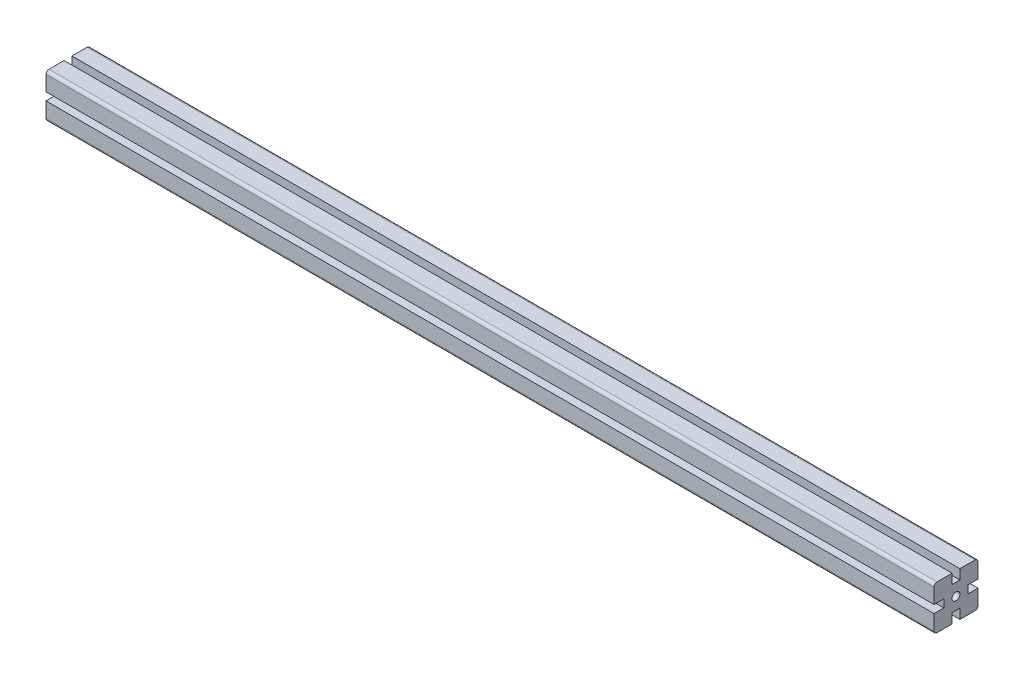
ISO-10303-21;
HEADER;
FILE_DESCRIPTION(('STEP AP214'),'2;1');
FILE_NAME('part.step','',(''),(''),'','','');
FILE_SCHEMA(('AUTOMOTIVE_DESIGN { 1 0 10303 214 1 1 1 1 }'));
ENDSEC;
DATA;
#1=APPLICATION_CONTEXT('core data for automotive mechanical design processes');
#2=APPLICATION_PROTOCOL_DEFINITION('international standard','automotive_design',2000,#1);
#3=PRODUCT_CONTEXT('',#1,'mechanical');
#4=PRODUCT('Part','Part','',(#3));
#5=PRODUCT_RELATED_PRODUCT_CATEGORY('part','',(#4));
#6=PRODUCT_DEFINITION_FORMATION('','',#4);
#7=PRODUCT_DEFINITION_CONTEXT('part definition',#1,'design');
#8=PRODUCT_DEFINITION('design','',#6,#7);
#9=PRODUCT_DEFINITION_SHAPE('','',#8);
#10=(LENGTH_UNIT() NAMED_UNIT(*) SI_UNIT(.MILLI.,.METRE.));
#11=(NAMED_UNIT(*) PLANE_ANGLE_UNIT() SI_UNIT($,.RADIAN.));
#12=(NAMED_UNIT(*) SI_UNIT($,.STERADIAN.) SOLID_ANGLE_UNIT());
#13=UNCERTAINTY_MEASURE_WITH_UNIT(LENGTH_MEASURE(1.E-05),#10,'distance_accuracy_value','');
#14=(GEOMETRIC_REPRESENTATION_CONTEXT(3) GLOBAL_UNCERTAINTY_ASSIGNED_CONTEXT((#13)) GLOBAL_UNIT_ASSIGNED_CONTEXT((#10,
#11,#12)) REPRESENTATION_CONTEXT('',''));
#15=CARTESIAN_POINT('',(0.,0.,0.));
#16=DIRECTION('',(0.,0.,1.));
#17=DIRECTION('',(1.,0.,0.));
#18=AXIS2_PLACEMENT_3D('',#15,#16,#17);
#19=CARTESIAN_POINT('',(92.,-22.5,-22.5));
#20=DIRECTION('',(0.,0.,-1.));
#21=DIRECTION('',(0.,1.,0.));
#22=AXIS2_PLACEMENT_3D('',#19,#20,#21);
#23=PLANE('',#22);
#24=DIRECTION('',(0.,1.,0.));
#25=VECTOR('',#24,1.);
#26=CARTESIAN_POINT('',(1000.,-22.5,-22.5));
#27=LINE('',#26,#25);
#28=CARTESIAN_POINT('',(1000.,-19.5,-22.5));
#29=VERTEX_POINT('',#28);
#30=CARTESIAN_POINT('',(1000.,-4.,-22.5));
#31=VERTEX_POINT('',#30);
#32=EDGE_CURVE('E269',#29,#31,#27,.T.);
#33=ORIENTED_EDGE('',*,*,#32,.F.);
#34=DIRECTION('',(1.,0.,0.));
#35=VECTOR('',#34,1.);
#36=CARTESIAN_POINT('',(92.,-19.5,-22.5));
#37=LINE('',#36,#35);
#38=CARTESIAN_POINT('',(92.,-19.5,-22.5));
#39=VERTEX_POINT('',#38);
#40=EDGE_CURVE('E199',#29,#39,#37,.F.);
#41=ORIENTED_EDGE('',*,*,#40,.T.);
#42=DIRECTION('',(0.,1.,0.));
#43=VECTOR('',#42,1.);
#44=CARTESIAN_POINT('',(92.,-22.5,-22.5));
#45=LINE('',#44,#43);
#46=CARTESIAN_POINT('',(92.,-4.,-22.5));
#47=VERTEX_POINT('',#46);
#48=EDGE_CURVE('E193',#39,#47,#45,.T.);
#49=ORIENTED_EDGE('',*,*,#48,.T.);
#50=DIRECTION('',(1.,0.,0.));
#51=VECTOR('',#50,1.);
#52=CARTESIAN_POINT('',(92.,-4.,-22.5));
#53=LINE('',#52,#51);
#54=EDGE_CURVE('E196',#47,#31,#53,.T.);
#55=ORIENTED_EDGE('',*,*,#54,.T.);
#56=EDGE_LOOP('',(#33,#41,#49,#55));
#57=FACE_BOUND('',#56,.T.);
#58=ADVANCED_FACE('F32',(#57),#23,.T.);
#59=CARTESIAN_POINT('',(92.,-22.5,-4.));
#60=DIRECTION('',(0.,-1.,0.));
#61=DIRECTION('',(0.,0.,-1.));
#62=AXIS2_PLACEMENT_3D('',#59,#60,#61);
#63=PLANE('',#62);
#64=DIRECTION('',(0.,0.,-1.));
#65=VECTOR('',#64,1.);
#66=CARTESIAN_POINT('',(92.,-22.5,-4.));
#67=LINE('',#66,#65);
#68=CARTESIAN_POINT('',(92.,-22.5,-4.));
#69=VERTEX_POINT('',#68);
#70=CARTESIAN_POINT('',(92.,-22.5,-19.5));
#71=VERTEX_POINT('',#70);
#72=EDGE_CURVE('E211',#69,#71,#67,.T.);
#73=ORIENTED_EDGE('',*,*,#72,.T.);
#74=DIRECTION('',(1.,0.,0.));
#75=VECTOR('',#74,1.);
#76=CARTESIAN_POINT('',(92.,-22.5,-19.5));
#77=LINE('',#76,#75);
#78=CARTESIAN_POINT('',(1000.,-22.5,-19.5));
#79=VERTEX_POINT('',#78);
#80=EDGE_CURVE('E375',#71,#79,#77,.T.);
#81=ORIENTED_EDGE('',*,*,#80,.T.);
#82=DIRECTION('',(0.,0.,-1.));
#83=VECTOR('',#82,1.);
#84=CARTESIAN_POINT('',(1000.,-22.5,-4.));
#85=LINE('',#84,#83);
#86=CARTESIAN_POINT('',(1000.,-22.5,-4.));
#87=VERTEX_POINT('',#86);
#88=EDGE_CURVE('E203',#87,#79,#85,.T.);
#89=ORIENTED_EDGE('',*,*,#88,.F.);
#90=DIRECTION('',(1.,0.,0.));
#91=VECTOR('',#90,1.);
#92=CARTESIAN_POINT('',(92.,-22.5,-4.));
#93=LINE('',#92,#91);
#94=EDGE_CURVE('E323',#69,#87,#93,.T.);
#95=ORIENTED_EDGE('',*,*,#94,.F.);
#96=EDGE_LOOP('',(#73,#81,#89,#95));
#97=FACE_BOUND('',#96,.T.);
#98=ADVANCED_FACE('F403',(#97),#63,.T.);
#99=CARTESIAN_POINT('',(92.,-12.5,-4.));
#100=DIRECTION('',(0.,0.,1.));
#101=DIRECTION('',(1.,0.,0.));
#102=AXIS2_PLACEMENT_3D('',#99,#100,#101);
#103=PLANE('',#102);
#104=DIRECTION('',(0.,-1.,0.));
#105=VECTOR('',#104,1.);
#106=CARTESIAN_POINT('',(1000.,-12.5,-4.));
#107=LINE('',#106,#105);
#108=CARTESIAN_POINT('',(1000.,-12.5,-4.));
#109=VERTEX_POINT('',#108);
#110=EDGE_CURVE('E318',#109,#87,#107,.T.);
#111=ORIENTED_EDGE('',*,*,#110,.F.);
#112=DIRECTION('',(1.,0.,0.));
#113=VECTOR('',#112,1.);
#114=CARTESIAN_POINT('',(92.,-12.5,-4.));
#115=LINE('',#114,#113);
#116=CARTESIAN_POINT('',(92.,-12.5,-4.));
#117=VERTEX_POINT('',#116);
#118=EDGE_CURVE('E326',#117,#109,#115,.T.);
#119=ORIENTED_EDGE('',*,*,#118,.F.);
#120=DIRECTION('',(0.,-1.,0.));
#121=VECTOR('',#120,1.);
#122=CARTESIAN_POINT('',(92.,-12.5,-4.));
#123=LINE('',#122,#121);
#124=EDGE_CURVE('E264',#117,#69,#123,.T.);
#125=ORIENTED_EDGE('',*,*,#124,.T.);
#126=ORIENTED_EDGE('',*,*,#94,.T.);
#127=EDGE_LOOP('',(#111,#119,#125,#126));
#128=FACE_BOUND('',#127,.T.);
#129=ADVANCED_FACE('F407',(#128),#103,.T.);
#130=CARTESIAN_POINT('',(92.,-12.5,4.));
#131=DIRECTION('',(0.,-1.,0.));
#132=DIRECTION('',(0.,0.,-1.));
#133=AXIS2_PLACEMENT_3D('',#130,#131,#132);
#134=PLANE('',#133);
#135=DIRECTION('',(0.,0.,-1.));
#136=VECTOR('',#135,1.);
#137=CARTESIAN_POINT('',(1000.,-12.5,4.));
#138=LINE('',#137,#136);
#139=CARTESIAN_POINT('',(1000.,-12.5,4.));
#140=VERTEX_POINT('',#139);
#141=EDGE_CURVE('E315',#140,#109,#138,.T.);
#142=ORIENTED_EDGE('',*,*,#141,.F.);
#143=DIRECTION('',(1.,0.,0.));
#144=VECTOR('',#143,1.);
#145=CARTESIAN_POINT('',(92.,-12.5,4.));
#146=LINE('',#145,#144);
#147=CARTESIAN_POINT('',(92.,-12.5,4.));
#148=VERTEX_POINT('',#147);
#149=EDGE_CURVE('E328',#148,#140,#146,.T.);
#150=ORIENTED_EDGE('',*,*,#149,.F.);
#151=DIRECTION('',(0.,0.,-1.));
#152=VECTOR('',#151,1.);
#153=CARTESIAN_POINT('',(92.,-12.5,4.));
#154=LINE('',#153,#152);
#155=EDGE_CURVE('E261',#148,#117,#154,.T.);
#156=ORIENTED_EDGE('',*,*,#155,.T.);
#157=ORIENTED_EDGE('',*,*,#118,.T.);
#158=EDGE_LOOP('',(#142,#150,#156,#157));
#159=FACE_BOUND('',#158,.T.);
#160=ADVANCED_FACE('F412',(#159),#134,.T.);
#161=CARTESIAN_POINT('',(92.,-22.5,4.));
#162=DIRECTION('',(0.,0.,-1.));
#163=DIRECTION('',(-1.,0.,0.));
#164=AXIS2_PLACEMENT_3D('',#161,#162,#163);
#165=PLANE('',#164);
#166=DIRECTION('',(0.,1.,0.));
#167=VECTOR('',#166,1.);
#168=CARTESIAN_POINT('',(1000.,-22.5,4.));
#169=LINE('',#168,#167);
#170=CARTESIAN_POINT('',(1000.,-22.5,4.));
#171=VERTEX_POINT('',#170);
#172=EDGE_CURVE('E312',#171,#140,#169,.T.);
#173=ORIENTED_EDGE('',*,*,#172,.F.);
#174=DIRECTION('',(1.,0.,0.));
#175=VECTOR('',#174,1.);
#176=CARTESIAN_POINT('',(92.,-22.5,4.));
#177=LINE('',#176,#175);
#178=CARTESIAN_POINT('',(92.,-22.5,4.));
#179=VERTEX_POINT('',#178);
#180=EDGE_CURVE('E330',#179,#171,#177,.T.);
#181=ORIENTED_EDGE('',*,*,#180,.F.);
#182=DIRECTION('',(0.,1.,0.));
#183=VECTOR('',#182,1.);
#184=CARTESIAN_POINT('',(92.,-22.5,4.));
#185=LINE('',#184,#183);
#186=EDGE_CURVE('E258',#179,#148,#185,.T.);
#187=ORIENTED_EDGE('',*,*,#186,.T.);
#188=ORIENTED_EDGE('',*,*,#149,.T.);
#189=EDGE_LOOP('',(#173,#181,#187,#188));
#190=FACE_BOUND('',#189,.T.);
#191=ADVANCED_FACE('F415',(#190),#165,.T.);
#192=CARTESIAN_POINT('',(92.,-22.5,22.5));
#193=DIRECTION('',(0.,-1.,0.));
#194=DIRECTION('',(0.,0.,-1.));
#195=AXIS2_PLACEMENT_3D('',#192,#193,#194);
#196=PLANE('',#195);
#197=DIRECTION('',(0.,0.,-1.));
#198=VECTOR('',#197,1.);
#199=CARTESIAN_POINT('',(1000.,-22.5,22.5));
#200=LINE('',#199,#198);
#201=CARTESIAN_POINT('',(1000.,-22.5,19.5));
#202=VERTEX_POINT('',#201);
#203=EDGE_CURVE('E310',#202,#171,#200,.T.);
#204=ORIENTED_EDGE('',*,*,#203,.F.);
#205=DIRECTION('',(1.,0.,0.));
#206=VECTOR('',#205,1.);
#207=CARTESIAN_POINT('',(92.,-22.5,19.5));
#208=LINE('',#207,#206);
#209=CARTESIAN_POINT('',(92.,-22.5,19.5));
#210=VERTEX_POINT('',#209);
#211=EDGE_CURVE('E366',#202,#210,#208,.F.);
#212=ORIENTED_EDGE('',*,*,#211,.T.);
#213=DIRECTION('',(0.,0.,-1.));
#214=VECTOR('',#213,1.);
#215=CARTESIAN_POINT('',(92.,-22.5,22.5));
#216=LINE('',#215,#214);
#217=EDGE_CURVE('E256',#210,#179,#216,.T.);
#218=ORIENTED_EDGE('',*,*,#217,.T.);
#219=ORIENTED_EDGE('',*,*,#180,.T.);
#220=EDGE_LOOP('',(#204,#212,#218,#219));
#221=FACE_BOUND('',#220,.T.);
#222=ADVANCED_FACE('F627',(#221),#196,.T.);
#223=CARTESIAN_POINT('',(92.,-4.,22.5));
#224=DIRECTION('',(0.,0.,1.));
#225=DIRECTION('',(0.,-1.,0.));
#226=AXIS2_PLACEMENT_3D('',#223,#224,#225);
#227=PLANE('',#226);
#228=DIRECTION('',(0.,-1.,0.));
#229=VECTOR('',#228,1.);
#230=CARTESIAN_POINT('',(92.,-4.,22.5));
#231=LINE('',#230,#229);
#232=CARTESIAN_POINT('',(92.,-4.,22.5));
#233=VERTEX_POINT('',#232);
#234=CARTESIAN_POINT('',(92.,-19.5,22.5));
#235=VERTEX_POINT('',#234);
#236=EDGE_CURVE('E253',#233,#235,#231,.T.);
#237=ORIENTED_EDGE('',*,*,#236,.T.);
#238=DIRECTION('',(1.,0.,0.));
#239=VECTOR('',#238,1.);
#240=CARTESIAN_POINT('',(92.,-19.5,22.5));
#241=LINE('',#240,#239);
#242=CARTESIAN_POINT('',(1000.,-19.5,22.5));
#243=VERTEX_POINT('',#242);
#244=EDGE_CURVE('E325',#235,#243,#241,.T.);
#245=ORIENTED_EDGE('',*,*,#244,.T.);
#246=DIRECTION('',(0.,-1.,0.));
#247=VECTOR('',#246,1.);
#248=CARTESIAN_POINT('',(1000.,-4.,22.5));
#249=LINE('',#248,#247);
#250=CARTESIAN_POINT('',(1000.,-4.,22.5));
#251=VERTEX_POINT('',#250);
#252=EDGE_CURVE('E307',#251,#243,#249,.T.);
#253=ORIENTED_EDGE('',*,*,#252,.F.);
#254=DIRECTION('',(1.,0.,0.));
#255=VECTOR('',#254,1.);
#256=CARTESIAN_POINT('',(92.,-4.,22.5));
#257=LINE('',#256,#255);
#258=EDGE_CURVE('E333',#233,#251,#257,.T.);
#259=ORIENTED_EDGE('',*,*,#258,.F.);
#260=EDGE_LOOP('',(#237,#245,#253,#259));
#261=FACE_BOUND('',#260,.T.);
#262=ADVANCED_FACE('F426',(#261),#227,.T.);
#263=CARTESIAN_POINT('',(92.,-4.,12.5));
#264=DIRECTION('',(0.,1.,0.));
#265=DIRECTION('',(0.,0.,1.));
#266=AXIS2_PLACEMENT_3D('',#263,#264,#265);
#267=PLANE('',#266);
#268=DIRECTION('',(0.,0.,1.));
#269=VECTOR('',#268,1.);
#270=CARTESIAN_POINT('',(1000.,-4.,12.5));
#271=LINE('',#270,#269);
#272=CARTESIAN_POINT('',(1000.,-4.,12.5));
#273=VERTEX_POINT('',#272);
#274=EDGE_CURVE('E304',#273,#251,#271,.T.);
#275=ORIENTED_EDGE('',*,*,#274,.F.);
#276=DIRECTION('',(1.,0.,0.));
#277=VECTOR('',#276,1.);
#278=CARTESIAN_POINT('',(92.,-4.,12.5));
#279=LINE('',#278,#277);
#280=CARTESIAN_POINT('',(92.,-4.,12.5));
#281=VERTEX_POINT('',#280);
#282=EDGE_CURVE('E335',#281,#273,#279,.T.);
#283=ORIENTED_EDGE('',*,*,#282,.F.);
#284=DIRECTION('',(0.,0.,1.));
#285=VECTOR('',#284,1.);
#286=CARTESIAN_POINT('',(92.,-4.,12.5));
#287=LINE('',#286,#285);
#288=EDGE_CURVE('E250',#281,#233,#287,.T.);
#289=ORIENTED_EDGE('',*,*,#288,.T.);
#290=ORIENTED_EDGE('',*,*,#258,.T.);
#291=EDGE_LOOP('',(#275,#283,#289,#290));
#292=FACE_BOUND('',#291,.T.);
#293=ADVANCED_FACE('F431',(#292),#267,.T.);
#294=CARTESIAN_POINT('',(92.,4.,12.5));
#295=DIRECTION('',(0.,0.,1.));
#296=DIRECTION('',(1.,0.,0.));
#297=AXIS2_PLACEMENT_3D('',#294,#295,#296);
#298=PLANE('',#297);
#299=DIRECTION('',(0.,-1.,0.));
#300=VECTOR('',#299,1.);
#301=CARTESIAN_POINT('',(1000.,4.,12.5));
#302=LINE('',#301,#300);
#303=CARTESIAN_POINT('',(1000.,4.,12.5));
#304=VERTEX_POINT('',#303);
#305=EDGE_CURVE('E301',#304,#273,#302,.T.);
#306=ORIENTED_EDGE('',*,*,#305,.F.);
#307=DIRECTION('',(1.,0.,0.));
#308=VECTOR('',#307,1.);
#309=CARTESIAN_POINT('',(92.,4.,12.5));
#310=LINE('',#309,#308);
#311=CARTESIAN_POINT('',(92.,4.,12.5));
#312=VERTEX_POINT('',#311);
#313=EDGE_CURVE('E337',#312,#304,#310,.T.);
#314=ORIENTED_EDGE('',*,*,#313,.F.);
#315=DIRECTION('',(0.,-1.,0.));
#316=VECTOR('',#315,1.);
#317=CARTESIAN_POINT('',(92.,4.,12.5));
#318=LINE('',#317,#316);
#319=EDGE_CURVE('E247',#312,#281,#318,.T.);
#320=ORIENTED_EDGE('',*,*,#319,.T.);
#321=ORIENTED_EDGE('',*,*,#282,.T.);
#322=EDGE_LOOP('',(#306,#314,#320,#321));
#323=FACE_BOUND('',#322,.T.);
#324=ADVANCED_FACE('F436',(#323),#298,.T.);
#325=CARTESIAN_POINT('',(92.,4.,22.5));
#326=DIRECTION('',(0.,-1.,0.));
#327=DIRECTION('',(0.,0.,-1.));
#328=AXIS2_PLACEMENT_3D('',#325,#326,#327);
#329=PLANE('',#328);
#330=DIRECTION('',(0.,0.,-1.));
#331=VECTOR('',#330,1.);
#332=CARTESIAN_POINT('',(1000.,4.,22.5));
#333=LINE('',#332,#331);
#334=CARTESIAN_POINT('',(1000.,4.,22.5));
#335=VERTEX_POINT('',#334);
#336=EDGE_CURVE('E298',#335,#304,#333,.T.);
#337=ORIENTED_EDGE('',*,*,#336,.F.);
#338=DIRECTION('',(1.,0.,0.));
#339=VECTOR('',#338,1.);
#340=CARTESIAN_POINT('',(92.,4.,22.5));
#341=LINE('',#340,#339);
#342=CARTESIAN_POINT('',(92.,4.,22.5));
#343=VERTEX_POINT('',#342);
#344=EDGE_CURVE('E339',#343,#335,#341,.T.);
#345=ORIENTED_EDGE('',*,*,#344,.F.);
#346=DIRECTION('',(0.,0.,-1.));
#347=VECTOR('',#346,1.);
#348=CARTESIAN_POINT('',(92.,4.,22.5));
#349=LINE('',#348,#347);
#350=EDGE_CURVE('E244',#343,#312,#349,.T.);
#351=ORIENTED_EDGE('',*,*,#350,.T.);
#352=ORIENTED_EDGE('',*,*,#313,.T.);
#353=EDGE_LOOP('',(#337,#345,#351,#352));
#354=FACE_BOUND('',#353,.T.);
#355=ADVANCED_FACE('F439',(#354),#329,.T.);
#356=CARTESIAN_POINT('',(92.,22.5,22.5));
#357=DIRECTION('',(0.,0.,1.));
#358=DIRECTION('',(0.,-1.,0.));
#359=AXIS2_PLACEMENT_3D('',#356,#357,#358);
#360=PLANE('',#359);
#361=DIRECTION('',(0.,-1.,0.));
#362=VECTOR('',#361,1.);
#363=CARTESIAN_POINT('',(1000.,22.5,22.5));
#364=LINE('',#363,#362);
#365=CARTESIAN_POINT('',(1000.,19.5,22.5));
#366=VERTEX_POINT('',#365);
#367=EDGE_CURVE('E296',#366,#335,#364,.T.);
#368=ORIENTED_EDGE('',*,*,#367,.F.);
#369=DIRECTION('',(1.,0.,0.));
#370=VECTOR('',#369,1.);
#371=CARTESIAN_POINT('',(92.,19.5,22.5));
#372=LINE('',#371,#370);
#373=CARTESIAN_POINT('',(92.,19.5,22.5));
#374=VERTEX_POINT('',#373);
#375=EDGE_CURVE('E382',#366,#374,#372,.F.);
#376=ORIENTED_EDGE('',*,*,#375,.T.);
#377=DIRECTION('',(0.,-1.,0.));
#378=VECTOR('',#377,1.);
#379=CARTESIAN_POINT('',(92.,22.5,22.5));
#380=LINE('',#379,#378);
#381=EDGE_CURVE('E242',#374,#343,#380,.T.);
#382=ORIENTED_EDGE('',*,*,#381,.T.);
#383=ORIENTED_EDGE('',*,*,#344,.T.);
#384=EDGE_LOOP('',(#368,#376,#382,#383));
#385=FACE_BOUND('',#384,.T.);
#386=ADVANCED_FACE('F591',(#385),#360,.T.);
#387=CARTESIAN_POINT('',(92.,22.5,4.));
#388=DIRECTION('',(0.,1.,0.));
#389=DIRECTION('',(0.,0.,1.));
#390=AXIS2_PLACEMENT_3D('',#387,#388,#389);
#391=PLANE('',#390);
#392=DIRECTION('',(0.,0.,1.));
#393=VECTOR('',#392,1.);
#394=CARTESIAN_POINT('',(92.,22.5,4.));
#395=LINE('',#394,#393);
#396=CARTESIAN_POINT('',(92.,22.5,4.));
#397=VERTEX_POINT('',#396);
#398=CARTESIAN_POINT('',(92.,22.5,19.5));
#399=VERTEX_POINT('',#398);
#400=EDGE_CURVE('E239',#397,#399,#395,.T.);
#401=ORIENTED_EDGE('',*,*,#400,.T.);
#402=DIRECTION('',(1.,0.,0.));
#403=VECTOR('',#402,1.);
#404=CARTESIAN_POINT('',(92.,22.5,19.5));
#405=LINE('',#404,#403);
#406=CARTESIAN_POINT('',(1000.,22.5,19.5));
#407=VERTEX_POINT('',#406);
#408=EDGE_CURVE('E379',#399,#407,#405,.T.);
#409=ORIENTED_EDGE('',*,*,#408,.T.);
#410=DIRECTION('',(0.,0.,1.));
#411=VECTOR('',#410,1.);
#412=CARTESIAN_POINT('',(1000.,22.5,4.));
#413=LINE('',#412,#411);
#414=CARTESIAN_POINT('',(1000.,22.5,4.));
#415=VERTEX_POINT('',#414);
#416=EDGE_CURVE('E293',#415,#407,#413,.T.);
#417=ORIENTED_EDGE('',*,*,#416,.F.);
#418=DIRECTION('',(1.,0.,0.));
#419=VECTOR('',#418,1.);
#420=CARTESIAN_POINT('',(92.,22.5,4.));
#421=LINE('',#420,#419);
#422=EDGE_CURVE('E342',#397,#415,#421,.T.);
#423=ORIENTED_EDGE('',*,*,#422,.F.);
#424=EDGE_LOOP('',(#401,#409,#417,#423));
#425=FACE_BOUND('',#424,.T.);
#426=ADVANCED_FACE('F451',(#425),#391,.T.);
#427=CARTESIAN_POINT('',(92.,12.5,4.));
#428=DIRECTION('',(0.,0.,-1.));
#429=DIRECTION('',(-1.,0.,0.));
#430=AXIS2_PLACEMENT_3D('',#427,#428,#429);
#431=PLANE('',#430);
#432=DIRECTION('',(0.,1.,0.));
#433=VECTOR('',#432,1.);
#434=CARTESIAN_POINT('',(1000.,12.5,4.));
#435=LINE('',#434,#433);
#436=CARTESIAN_POINT('',(1000.,12.5,4.));
#437=VERTEX_POINT('',#436);
#438=EDGE_CURVE('E290',#437,#415,#435,.T.);
#439=ORIENTED_EDGE('',*,*,#438,.F.);
#440=DIRECTION('',(1.,0.,0.));
#441=VECTOR('',#440,1.);
#442=CARTESIAN_POINT('',(92.,12.5,4.));
#443=LINE('',#442,#441);
#444=CARTESIAN_POINT('',(92.,12.5,4.));
#445=VERTEX_POINT('',#444);
#446=EDGE_CURVE('E344',#445,#437,#443,.T.);
#447=ORIENTED_EDGE('',*,*,#446,.F.);
#448=DIRECTION('',(0.,1.,0.));
#449=VECTOR('',#448,1.);
#450=CARTESIAN_POINT('',(92.,12.5,4.));
#451=LINE('',#450,#449);
#452=EDGE_CURVE('E236',#445,#397,#451,.T.);
#453=ORIENTED_EDGE('',*,*,#452,.T.);
#454=ORIENTED_EDGE('',*,*,#422,.T.);
#455=EDGE_LOOP('',(#439,#447,#453,#454));
#456=FACE_BOUND('',#455,.T.);
#457=ADVANCED_FACE('F456',(#456),#431,.T.);
#458=CARTESIAN_POINT('',(92.,12.5,-4.));
#459=DIRECTION('',(0.,1.,0.));
#460=DIRECTION('',(0.,0.,1.));
#461=AXIS2_PLACEMENT_3D('',#458,#459,#460);
#462=PLANE('',#461);
#463=DIRECTION('',(0.,0.,1.));
#464=VECTOR('',#463,1.);
#465=CARTESIAN_POINT('',(1000.,12.5,-4.));
#466=LINE('',#465,#464);
#467=CARTESIAN_POINT('',(1000.,12.5,-4.));
#468=VERTEX_POINT('',#467);
#469=EDGE_CURVE('E287',#468,#437,#466,.T.);
#470=ORIENTED_EDGE('',*,*,#469,.F.);
#471=DIRECTION('',(1.,0.,0.));
#472=VECTOR('',#471,1.);
#473=CARTESIAN_POINT('',(92.,12.5,-4.));
#474=LINE('',#473,#472);
#475=CARTESIAN_POINT('',(92.,12.5,-4.));
#476=VERTEX_POINT('',#475);
#477=EDGE_CURVE('E346',#476,#468,#474,.T.);
#478=ORIENTED_EDGE('',*,*,#477,.F.);
#479=DIRECTION('',(0.,0.,1.));
#480=VECTOR('',#479,1.);
#481=CARTESIAN_POINT('',(92.,12.5,-4.));
#482=LINE('',#481,#480);
#483=EDGE_CURVE('E233',#476,#445,#482,.T.);
#484=ORIENTED_EDGE('',*,*,#483,.T.);
#485=ORIENTED_EDGE('',*,*,#446,.T.);
#486=EDGE_LOOP('',(#470,#478,#484,#485));
#487=FACE_BOUND('',#486,.T.);
#488=ADVANCED_FACE('F461',(#487),#462,.T.);
#489=CARTESIAN_POINT('',(92.,22.5,-4.));
#490=DIRECTION('',(0.,0.,1.));
#491=DIRECTION('',(1.,0.,0.));
#492=AXIS2_PLACEMENT_3D('',#489,#490,#491);
#493=PLANE('',#492);
#494=DIRECTION('',(0.,-1.,0.));
#495=VECTOR('',#494,1.);
#496=CARTESIAN_POINT('',(1000.,22.5,-4.));
#497=LINE('',#496,#495);
#498=CARTESIAN_POINT('',(1000.,22.5,-4.));
#499=VERTEX_POINT('',#498);
#500=EDGE_CURVE('E284',#499,#468,#497,.T.);
#501=ORIENTED_EDGE('',*,*,#500,.F.);
#502=DIRECTION('',(1.,0.,0.));
#503=VECTOR('',#502,1.);
#504=CARTESIAN_POINT('',(92.,22.5,-4.));
#505=LINE('',#504,#503);
#506=CARTESIAN_POINT('',(92.,22.5,-4.));
#507=VERTEX_POINT('',#506);
#508=EDGE_CURVE('E348',#507,#499,#505,.T.);
#509=ORIENTED_EDGE('',*,*,#508,.F.);
#510=DIRECTION('',(0.,-1.,0.));
#511=VECTOR('',#510,1.);
#512=CARTESIAN_POINT('',(92.,22.5,-4.));
#513=LINE('',#512,#511);
#514=EDGE_CURVE('E230',#507,#476,#513,.T.);
#515=ORIENTED_EDGE('',*,*,#514,.T.);
#516=ORIENTED_EDGE('',*,*,#477,.T.);
#517=EDGE_LOOP('',(#501,#509,#515,#516));
#518=FACE_BOUND('',#517,.T.);
#519=ADVANCED_FACE('F464',(#518),#493,.T.);
#520=CARTESIAN_POINT('',(92.,22.5,-22.5));
#521=DIRECTION('',(0.,1.,0.));
#522=DIRECTION('',(0.,0.,1.));
#523=AXIS2_PLACEMENT_3D('',#520,#521,#522);
#524=PLANE('',#523);
#525=DIRECTION('',(0.,0.,1.));
#526=VECTOR('',#525,1.);
#527=CARTESIAN_POINT('',(1000.,22.5,-22.5));
#528=LINE('',#527,#526);
#529=CARTESIAN_POINT('',(1000.,22.5,-19.5));
#530=VERTEX_POINT('',#529);
#531=EDGE_CURVE('E282',#530,#499,#528,.T.);
#532=ORIENTED_EDGE('',*,*,#531,.F.);
#533=DIRECTION('',(1.,0.,0.));
#534=VECTOR('',#533,1.);
#535=CARTESIAN_POINT('',(92.,22.5,-19.5));
#536=LINE('',#535,#534);
#537=CARTESIAN_POINT('',(92.,22.5,-19.5));
#538=VERTEX_POINT('',#537);
#539=EDGE_CURVE('E11',#530,#538,#536,.F.);
#540=ORIENTED_EDGE('',*,*,#539,.T.);
#541=DIRECTION('',(0.,0.,1.));
#542=VECTOR('',#541,1.);
#543=CARTESIAN_POINT('',(92.,22.5,-22.5));
#544=LINE('',#543,#542);
#545=EDGE_CURVE('E228',#538,#507,#544,.T.);
#546=ORIENTED_EDGE('',*,*,#545,.T.);
#547=ORIENTED_EDGE('',*,*,#508,.T.);
#548=EDGE_LOOP('',(#532,#540,#546,#547));
#549=FACE_BOUND('',#548,.T.);
#550=ADVANCED_FACE('F555',(#549),#524,.T.);
#551=CARTESIAN_POINT('',(92.,4.,-22.5));
#552=DIRECTION('',(0.,0.,-1.));
#553=DIRECTION('',(0.,1.,0.));
#554=AXIS2_PLACEMENT_3D('',#551,#552,#553);
#555=PLANE('',#554);
#556=DIRECTION('',(0.,1.,0.));
#557=VECTOR('',#556,1.);
#558=CARTESIAN_POINT('',(92.,4.,-22.5));
#559=LINE('',#558,#557);
#560=CARTESIAN_POINT('',(92.,4.,-22.5));
#561=VERTEX_POINT('',#560);
#562=CARTESIAN_POINT('',(92.,19.5,-22.5));
#563=VERTEX_POINT('',#562);
#564=EDGE_CURVE('E226',#561,#563,#559,.T.);
#565=ORIENTED_EDGE('',*,*,#564,.T.);
#566=DIRECTION('',(1.,0.,0.));
#567=VECTOR('',#566,1.);
#568=CARTESIAN_POINT('',(92.,19.5,-22.5));
#569=LINE('',#568,#567);
#570=CARTESIAN_POINT('',(1000.,19.5,-22.5));
#571=VERTEX_POINT('',#570);
#572=EDGE_CURVE('E40',#563,#571,#569,.T.);
#573=ORIENTED_EDGE('',*,*,#572,.T.);
#574=DIRECTION('',(0.,1.,0.));
#575=VECTOR('',#574,1.);
#576=CARTESIAN_POINT('',(1000.,4.,-22.5));
#577=LINE('',#576,#575);
#578=CARTESIAN_POINT('',(1000.,4.,-22.5));
#579=VERTEX_POINT('',#578);
#580=EDGE_CURVE('E279',#579,#571,#577,.T.);
#581=ORIENTED_EDGE('',*,*,#580,.F.);
#582=DIRECTION('',(1.,0.,0.));
#583=VECTOR('',#582,1.);
#584=CARTESIAN_POINT('',(92.,4.,-22.5));
#585=LINE('',#584,#583);
#586=EDGE_CURVE('E351',#561,#579,#585,.T.);
#587=ORIENTED_EDGE('',*,*,#586,.F.);
#588=EDGE_LOOP('',(#565,#573,#581,#587));
#589=FACE_BOUND('',#588,.T.);
#590=ADVANCED_FACE('F387',(#589),#555,.T.);
#591=CARTESIAN_POINT('',(92.,4.,-12.5));
#592=DIRECTION('',(0.,-1.,0.));
#593=DIRECTION('',(0.,0.,-1.));
#594=AXIS2_PLACEMENT_3D('',#591,#592,#593);
#595=PLANE('',#594);
#596=DIRECTION('',(0.,0.,-1.));
#597=VECTOR('',#596,1.);
#598=CARTESIAN_POINT('',(1000.,4.,-12.5));
#599=LINE('',#598,#597);
#600=CARTESIAN_POINT('',(1000.,4.,-12.5));
#601=VERTEX_POINT('',#600);
#602=EDGE_CURVE('E276',#601,#579,#599,.T.);
#603=ORIENTED_EDGE('',*,*,#602,.F.);
#604=DIRECTION('',(1.,0.,0.));
#605=VECTOR('',#604,1.);
#606=CARTESIAN_POINT('',(92.,4.,-12.5));
#607=LINE('',#606,#605);
#608=CARTESIAN_POINT('',(92.,4.,-12.5));
#609=VERTEX_POINT('',#608);
#610=EDGE_CURVE('E353',#609,#601,#607,.T.);
#611=ORIENTED_EDGE('',*,*,#610,.F.);
#612=DIRECTION('',(0.,0.,-1.));
#613=VECTOR('',#612,1.);
#614=CARTESIAN_POINT('',(92.,4.,-12.5));
#615=LINE('',#614,#613);
#616=EDGE_CURVE('E220',#609,#561,#615,.T.);
#617=ORIENTED_EDGE('',*,*,#616,.T.);
#618=ORIENTED_EDGE('',*,*,#586,.T.);
#619=EDGE_LOOP('',(#603,#611,#617,#618));
#620=FACE_BOUND('',#619,.T.);
#621=ADVANCED_FACE('F394',(#620),#595,.T.);
#622=CARTESIAN_POINT('',(92.,-4.,-12.5));
#623=DIRECTION('',(0.,0.,-1.));
#624=DIRECTION('',(-1.,0.,0.));
#625=AXIS2_PLACEMENT_3D('',#622,#623,#624);
#626=PLANE('',#625);
#627=DIRECTION('',(0.,1.,0.));
#628=VECTOR('',#627,1.);
#629=CARTESIAN_POINT('',(1000.,-4.,-12.5));
#630=LINE('',#629,#628);
#631=CARTESIAN_POINT('',(1000.,-4.,-12.5));
#632=VERTEX_POINT('',#631);
#633=EDGE_CURVE('E273',#632,#601,#630,.T.);
#634=ORIENTED_EDGE('',*,*,#633,.F.);
#635=DIRECTION('',(1.,0.,0.));
#636=VECTOR('',#635,1.);
#637=CARTESIAN_POINT('',(92.,-4.,-12.5));
#638=LINE('',#637,#636);
#639=CARTESIAN_POINT('',(92.,-4.,-12.5));
#640=VERTEX_POINT('',#639);
#641=EDGE_CURVE('E210',#640,#632,#638,.T.);
#642=ORIENTED_EDGE('',*,*,#641,.F.);
#643=DIRECTION('',(0.,1.,0.));
#644=VECTOR('',#643,1.);
#645=CARTESIAN_POINT('',(92.,-4.,-12.5));
#646=LINE('',#645,#644);
#647=EDGE_CURVE('E218',#640,#609,#646,.T.);
#648=ORIENTED_EDGE('',*,*,#647,.T.);
#649=ORIENTED_EDGE('',*,*,#610,.T.);
#650=EDGE_LOOP('',(#634,#642,#648,#649));
#651=FACE_BOUND('',#650,.T.);
#652=ADVANCED_FACE('F396',(#651),#626,.T.);
#653=CARTESIAN_POINT('',(92.,-4.,-22.5));
#654=DIRECTION('',(0.,1.,0.));
#655=DIRECTION('',(0.,0.,1.));
#656=AXIS2_PLACEMENT_3D('',#653,#654,#655);
#657=PLANE('',#656);
#658=DIRECTION('',(0.,0.,1.));
#659=VECTOR('',#658,1.);
#660=CARTESIAN_POINT('',(1000.,-4.,-22.5));
#661=LINE('',#660,#659);
#662=EDGE_CURVE('E209',#31,#632,#661,.T.);
#663=ORIENTED_EDGE('',*,*,#662,.F.);
#664=ORIENTED_EDGE('',*,*,#54,.F.);
#665=DIRECTION('',(0.,0.,1.));
#666=VECTOR('',#665,1.);
#667=CARTESIAN_POINT('',(92.,-4.,-22.5));
#668=LINE('',#667,#666);
#669=EDGE_CURVE('E202',#47,#640,#668,.T.);
#670=ORIENTED_EDGE('',*,*,#669,.T.);
#671=ORIENTED_EDGE('',*,*,#641,.T.);
#672=EDGE_LOOP('',(#663,#664,#670,#671));
#673=FACE_BOUND('',#672,.T.);
#674=ADVANCED_FACE('F207',(#673),#657,.T.);
#675=CARTESIAN_POINT('',(92.,0.,0.));
#676=DIRECTION('',(1.,0.,0.));
#677=DIRECTION('',(0.,0.,-1.));
#678=AXIS2_PLACEMENT_3D('',#675,#676,#677);
#679=PLANE('',#678);
#680=CARTESIAN_POINT('',(92.,0.,0.));
#681=DIRECTION('',(1.,0.,0.));
#682=DIRECTION('',(0.,0.,1.));
#683=AXIS2_PLACEMENT_3D('',#680,#681,#682);
#684=CIRCLE('',#683,4.);
#685=CARTESIAN_POINT('',(92.,0.,4.));
#686=VERTEX_POINT('',#685);
#687=EDGE_CURVE('E271',#686,#686,#684,.T.);
#688=ORIENTED_EDGE('',*,*,#687,.T.);
#689=EDGE_LOOP('',(#688));
#690=FACE_BOUND('',#689,.T.);
#691=ORIENTED_EDGE('',*,*,#217,.F.);
#692=CARTESIAN_POINT('',(92.,-19.5,19.5));
#693=DIRECTION('',(1.,0.,0.));
#694=DIRECTION('',(0.,0.,-1.));
#695=AXIS2_PLACEMENT_3D('',#692,#693,#694);
#696=CIRCLE('',#695,3.);
#697=EDGE_CURVE('E373',#210,#235,#696,.F.);
#698=ORIENTED_EDGE('',*,*,#697,.T.);
#699=ORIENTED_EDGE('',*,*,#236,.F.);
#700=ORIENTED_EDGE('',*,*,#288,.F.);
#701=ORIENTED_EDGE('',*,*,#319,.F.);
#702=ORIENTED_EDGE('',*,*,#350,.F.);
#703=ORIENTED_EDGE('',*,*,#381,.F.);
#704=CARTESIAN_POINT('',(92.,19.5,19.5));
#705=DIRECTION('',(1.,0.,0.));
#706=DIRECTION('',(0.,0.,-1.));
#707=AXIS2_PLACEMENT_3D('',#704,#705,#706);
#708=CIRCLE('',#707,3.);
#709=EDGE_CURVE('E369',#374,#399,#708,.F.);
#710=ORIENTED_EDGE('',*,*,#709,.T.);
#711=ORIENTED_EDGE('',*,*,#400,.F.);
#712=ORIENTED_EDGE('',*,*,#452,.F.);
#713=ORIENTED_EDGE('',*,*,#483,.F.);
#714=ORIENTED_EDGE('',*,*,#514,.F.);
#715=ORIENTED_EDGE('',*,*,#545,.F.);
#716=CARTESIAN_POINT('',(92.,19.5,-19.5));
#717=DIRECTION('',(1.,0.,0.));
#718=DIRECTION('',(0.,0.,-1.));
#719=AXIS2_PLACEMENT_3D('',#716,#717,#718);
#720=CIRCLE('',#719,3.);
#721=EDGE_CURVE('E47',#538,#563,#720,.F.);
#722=ORIENTED_EDGE('',*,*,#721,.T.);
#723=ORIENTED_EDGE('',*,*,#564,.F.);
#724=ORIENTED_EDGE('',*,*,#616,.F.);
#725=ORIENTED_EDGE('',*,*,#647,.F.);
#726=ORIENTED_EDGE('',*,*,#669,.F.);
#727=ORIENTED_EDGE('',*,*,#48,.F.);
#728=CARTESIAN_POINT('',(92.,-19.5,-19.5));
#729=DIRECTION('',(1.,0.,0.));
#730=DIRECTION('',(0.,0.,-1.));
#731=AXIS2_PLACEMENT_3D('',#728,#729,#730);
#732=CIRCLE('',#731,3.);
#733=EDGE_CURVE('E371',#39,#71,#732,.F.);
#734=ORIENTED_EDGE('',*,*,#733,.T.);
#735=ORIENTED_EDGE('',*,*,#72,.F.);
#736=ORIENTED_EDGE('',*,*,#124,.F.);
#737=ORIENTED_EDGE('',*,*,#155,.F.);
#738=ORIENTED_EDGE('',*,*,#186,.F.);
#739=EDGE_LOOP('',(#691,#698,#699,#700,#701,#702,#703,#710,#711,#712,#713,#714,#715,#722,#723,
#724,#725,#726,#727,#734,#735,#736,#737,#738));
#740=FACE_BOUND('',#739,.T.);
#741=ADVANCED_FACE('F215',(#690,#740),#679,.F.);
#742=CARTESIAN_POINT('',(1000.,0.,0.));
#743=DIRECTION('',(1.,0.,0.));
#744=DIRECTION('',(0.,0.,-1.));
#745=AXIS2_PLACEMENT_3D('',#742,#743,#744);
#746=PLANE('',#745);
#747=CARTESIAN_POINT('',(1000.,0.,0.));
#748=DIRECTION('',(1.,0.,0.));
#749=DIRECTION('',(0.,0.,1.));
#750=AXIS2_PLACEMENT_3D('',#747,#748,#749);
#751=CIRCLE('',#750,4.);
#752=CARTESIAN_POINT('',(1000.,0.,4.));
#753=VERTEX_POINT('',#752);
#754=EDGE_CURVE('E689',#753,#753,#751,.T.);
#755=ORIENTED_EDGE('',*,*,#754,.F.);
#756=EDGE_LOOP('',(#755));
#757=FACE_BOUND('',#756,.T.);
#758=ORIENTED_EDGE('',*,*,#252,.T.);
#759=CARTESIAN_POINT('',(1000.,-19.5,19.5));
#760=DIRECTION('',(1.,0.,0.));
#761=DIRECTION('',(0.,0.,-1.));
#762=AXIS2_PLACEMENT_3D('',#759,#760,#761);
#763=CIRCLE('',#762,3.);
#764=EDGE_CURVE('E364',#243,#202,#763,.T.);
#765=ORIENTED_EDGE('',*,*,#764,.T.);
#766=ORIENTED_EDGE('',*,*,#203,.T.);
#767=ORIENTED_EDGE('',*,*,#172,.T.);
#768=ORIENTED_EDGE('',*,*,#141,.T.);
#769=ORIENTED_EDGE('',*,*,#110,.T.);
#770=ORIENTED_EDGE('',*,*,#88,.T.);
#771=CARTESIAN_POINT('',(1000.,-19.5,-19.5));
#772=DIRECTION('',(1.,0.,0.));
#773=DIRECTION('',(0.,0.,-1.));
#774=AXIS2_PLACEMENT_3D('',#771,#772,#773);
#775=CIRCLE('',#774,3.);
#776=EDGE_CURVE('E362',#79,#29,#775,.T.);
#777=ORIENTED_EDGE('',*,*,#776,.T.);
#778=ORIENTED_EDGE('',*,*,#32,.T.);
#779=ORIENTED_EDGE('',*,*,#662,.T.);
#780=ORIENTED_EDGE('',*,*,#633,.T.);
#781=ORIENTED_EDGE('',*,*,#602,.T.);
#782=ORIENTED_EDGE('',*,*,#580,.T.);
#783=CARTESIAN_POINT('',(1000.,19.5,-19.5));
#784=DIRECTION('',(1.,0.,0.));
#785=DIRECTION('',(0.,0.,-1.));
#786=AXIS2_PLACEMENT_3D('',#783,#784,#785);
#787=CIRCLE('',#786,3.);
#788=EDGE_CURVE('E358',#571,#530,#787,.T.);
#789=ORIENTED_EDGE('',*,*,#788,.T.);
#790=ORIENTED_EDGE('',*,*,#531,.T.);
#791=ORIENTED_EDGE('',*,*,#500,.T.);
#792=ORIENTED_EDGE('',*,*,#469,.T.);
#793=ORIENTED_EDGE('',*,*,#438,.T.);
#794=ORIENTED_EDGE('',*,*,#416,.T.);
#795=CARTESIAN_POINT('',(1000.,19.5,19.5));
#796=DIRECTION('',(1.,0.,0.));
#797=DIRECTION('',(0.,0.,-1.));
#798=AXIS2_PLACEMENT_3D('',#795,#796,#797);
#799=CIRCLE('',#798,3.);
#800=EDGE_CURVE('E360',#407,#366,#799,.T.);
#801=ORIENTED_EDGE('',*,*,#800,.T.);
#802=ORIENTED_EDGE('',*,*,#367,.T.);
#803=ORIENTED_EDGE('',*,*,#336,.T.);
#804=ORIENTED_EDGE('',*,*,#305,.T.);
#805=ORIENTED_EDGE('',*,*,#274,.T.);
#806=EDGE_LOOP('',(#758,#765,#766,#767,#768,#769,#770,#777,#778,#779,#780,#781,#782,#789,#790,
#791,#792,#793,#794,#801,#802,#803,#804,#805));
#807=FACE_BOUND('',#806,.T.);
#808=ADVANCED_FACE('F390',(#757,#807),#746,.T.);
#809=CARTESIAN_POINT('',(92.,0.,0.));
#810=DIRECTION('',(1.,0.,0.));
#811=DIRECTION('',(0.,0.,-1.));
#812=AXIS2_PLACEMENT_3D('',#809,#810,#811);
#813=CYLINDRICAL_SURFACE('',#812,4.);
#814=ORIENTED_EDGE('',*,*,#687,.F.);
#815=EDGE_LOOP('',(#814));
#816=FACE_BOUND('',#815,.T.);
#817=ORIENTED_EDGE('',*,*,#754,.T.);
#818=EDGE_LOOP('',(#817));
#819=FACE_BOUND('',#818,.T.);
#820=ADVANCED_FACE('F481',(#816,#819),#813,.F.);
#821=CARTESIAN_POINT('',(92.,-19.5,19.5));
#822=DIRECTION('',(1.,0.,0.));
#823=DIRECTION('',(0.,0.,-1.));
#824=AXIS2_PLACEMENT_3D('',#821,#822,#823);
#825=CYLINDRICAL_SURFACE('',#824,3.);
#826=ORIENTED_EDGE('',*,*,#697,.F.);
#827=ORIENTED_EDGE('',*,*,#211,.F.);
#828=ORIENTED_EDGE('',*,*,#764,.F.);
#829=ORIENTED_EDGE('',*,*,#244,.F.);
#830=EDGE_LOOP('',(#826,#827,#828,#829));
#831=FACE_BOUND('',#830,.T.);
#832=ADVANCED_FACE('F423',(#831),#825,.T.);
#833=CARTESIAN_POINT('',(92.,-19.5,-19.5));
#834=DIRECTION('',(1.,0.,0.));
#835=DIRECTION('',(0.,0.,-1.));
#836=AXIS2_PLACEMENT_3D('',#833,#834,#835);
#837=CYLINDRICAL_SURFACE('',#836,3.);
#838=ORIENTED_EDGE('',*,*,#733,.F.);
#839=ORIENTED_EDGE('',*,*,#40,.F.);
#840=ORIENTED_EDGE('',*,*,#776,.F.);
#841=ORIENTED_EDGE('',*,*,#80,.F.);
#842=EDGE_LOOP('',(#838,#839,#840,#841));
#843=FACE_BOUND('',#842,.T.);
#844=ADVANCED_FACE('F398',(#843),#837,.T.);
#845=CARTESIAN_POINT('',(92.,19.5,19.5));
#846=DIRECTION('',(1.,0.,0.));
#847=DIRECTION('',(0.,0.,-1.));
#848=AXIS2_PLACEMENT_3D('',#845,#846,#847);
#849=CYLINDRICAL_SURFACE('',#848,3.);
#850=ORIENTED_EDGE('',*,*,#709,.F.);
#851=ORIENTED_EDGE('',*,*,#375,.F.);
#852=ORIENTED_EDGE('',*,*,#800,.F.);
#853=ORIENTED_EDGE('',*,*,#408,.F.);
#854=EDGE_LOOP('',(#850,#851,#852,#853));
#855=FACE_BOUND('',#854,.T.);
#856=ADVANCED_FACE('F448',(#855),#849,.T.);
#857=CARTESIAN_POINT('',(92.,19.5,-19.5));
#858=DIRECTION('',(1.,0.,0.));
#859=DIRECTION('',(0.,0.,-1.));
#860=AXIS2_PLACEMENT_3D('',#857,#858,#859);
#861=CYLINDRICAL_SURFACE('',#860,3.);
#862=ORIENTED_EDGE('',*,*,#721,.F.);
#863=ORIENTED_EDGE('',*,*,#539,.F.);
#864=ORIENTED_EDGE('',*,*,#788,.F.);
#865=ORIENTED_EDGE('',*,*,#572,.F.);
#866=EDGE_LOOP('',(#862,#863,#864,#865));
#867=FACE_BOUND('',#866,.T.);
#868=ADVANCED_FACE('F34',(#867),#861,.T.);
#869=CLOSED_SHELL('',(#58,#98,#129,#160,#191,#222,#262,#293,#324,#355,#386,#426,#457,#488,#519,
#550,#590,#621,#652,#674,#741,#808,#820,#832,#844,#856,#868));
#870=MANIFOLD_SOLID_BREP('B2',#869);
#871=ADVANCED_BREP_SHAPE_REPRESENTATION('',(#18,#870),#14);
#872=SHAPE_DEFINITION_REPRESENTATION(#9,#871);
ENDSEC;
END-ISO-10303-21;
